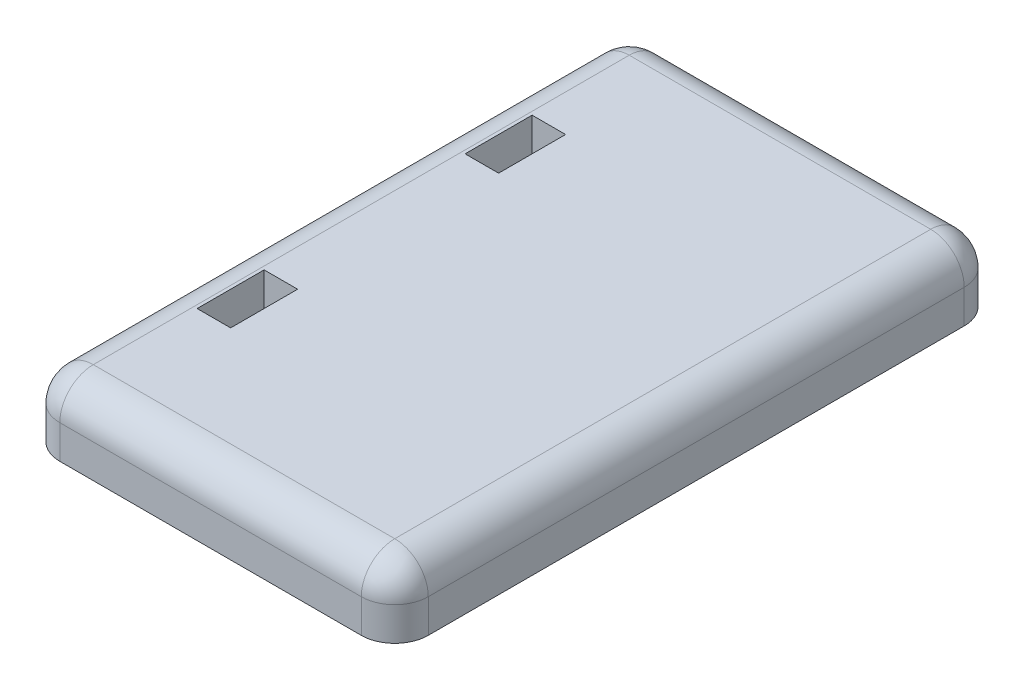
ISO-10303-21;
HEADER;
FILE_DESCRIPTION(('STEP AP214'),'2;1');
FILE_NAME('part.step','',(''),(''),'','','');
FILE_SCHEMA(('AUTOMOTIVE_DESIGN { 1 0 10303 214 1 1 1 1 }'));
ENDSEC;
DATA;
#1=APPLICATION_CONTEXT('core data for automotive mechanical design processes');
#2=APPLICATION_PROTOCOL_DEFINITION('international standard','automotive_design',2000,#1);
#3=PRODUCT_CONTEXT('',#1,'mechanical');
#4=PRODUCT('Part','Part','',(#3));
#5=PRODUCT_RELATED_PRODUCT_CATEGORY('part','',(#4));
#6=PRODUCT_DEFINITION_FORMATION('','',#4);
#7=PRODUCT_DEFINITION_CONTEXT('part definition',#1,'design');
#8=PRODUCT_DEFINITION('design','',#6,#7);
#9=PRODUCT_DEFINITION_SHAPE('','',#8);
#10=(LENGTH_UNIT() NAMED_UNIT(*) SI_UNIT(.MILLI.,.METRE.));
#11=(NAMED_UNIT(*) PLANE_ANGLE_UNIT() SI_UNIT($,.RADIAN.));
#12=(NAMED_UNIT(*) SI_UNIT($,.STERADIAN.) SOLID_ANGLE_UNIT());
#13=UNCERTAINTY_MEASURE_WITH_UNIT(LENGTH_MEASURE(1.E-05),#10,'distance_accuracy_value','');
#14=(GEOMETRIC_REPRESENTATION_CONTEXT(3) GLOBAL_UNCERTAINTY_ASSIGNED_CONTEXT((#13)) GLOBAL_UNIT_ASSIGNED_CONTEXT((#10,
#11,#12)) REPRESENTATION_CONTEXT('',''));
#15=CARTESIAN_POINT('',(0.,0.,0.));
#16=DIRECTION('',(0.,0.,1.));
#17=DIRECTION('',(1.,0.,0.));
#18=AXIS2_PLACEMENT_3D('',#15,#16,#17);
#19=CARTESIAN_POINT('',(0.,10.,0.));
#20=DIRECTION('',(0.,-1.,0.));
#21=DIRECTION('',(0.,0.,-1.));
#22=AXIS2_PLACEMENT_3D('',#19,#20,#21);
#23=PLANE('',#22);
#24=DIRECTION('',(0.,0.,1.));
#25=VECTOR('',#24,1.);
#26=CARTESIAN_POINT('',(-22.5,10.,0.));
#27=LINE('',#26,#25);
#28=CARTESIAN_POINT('',(-22.5,10.,-40.));
#29=VERTEX_POINT('',#28);
#30=CARTESIAN_POINT('',(-22.5,10.,40.));
#31=VERTEX_POINT('',#30);
#32=EDGE_CURVE('E248',#29,#31,#27,.T.);
#33=ORIENTED_EDGE('',*,*,#32,.T.);
#34=DIRECTION('',(1.,0.,0.));
#35=VECTOR('',#34,1.);
#36=CARTESIAN_POINT('',(0.,10.,40.));
#37=LINE('',#36,#35);
#38=CARTESIAN_POINT('',(22.5,10.,40.));
#39=VERTEX_POINT('',#38);
#40=EDGE_CURVE('E11',#31,#39,#37,.T.);
#41=ORIENTED_EDGE('',*,*,#40,.T.);
#42=DIRECTION('',(0.,0.,-1.));
#43=VECTOR('',#42,1.);
#44=CARTESIAN_POINT('',(22.5,10.,0.));
#45=LINE('',#44,#43);
#46=CARTESIAN_POINT('',(22.5,10.,-40.));
#47=VERTEX_POINT('',#46);
#48=EDGE_CURVE('E288',#39,#47,#45,.T.);
#49=ORIENTED_EDGE('',*,*,#48,.T.);
#50=DIRECTION('',(-1.,0.,0.));
#51=VECTOR('',#50,1.);
#52=CARTESIAN_POINT('',(0.,10.,-40.));
#53=LINE('',#52,#51);
#54=EDGE_CURVE('E267',#47,#29,#53,.T.);
#55=ORIENTED_EDGE('',*,*,#54,.T.);
#56=EDGE_LOOP('',(#33,#41,#49,#55));
#57=FACE_BOUND('',#56,.T.);
#58=DIRECTION('',(0.,0.,1.));
#59=VECTOR('',#58,1.);
#60=CARTESIAN_POINT('',(-17.,10.,15.));
#61=LINE('',#60,#59);
#62=CARTESIAN_POINT('',(-17.,10.,15.));
#63=VERTEX_POINT('',#62);
#64=CARTESIAN_POINT('',(-17.,10.,25.));
#65=VERTEX_POINT('',#64);
#66=EDGE_CURVE('E225',#63,#65,#61,.T.);
#67=ORIENTED_EDGE('',*,*,#66,.T.);
#68=DIRECTION('',(1.,0.,0.));
#69=VECTOR('',#68,1.);
#70=CARTESIAN_POINT('',(-22.,10.,25.));
#71=LINE('',#70,#69);
#72=CARTESIAN_POINT('',(-22.,10.,25.));
#73=VERTEX_POINT('',#72);
#74=EDGE_CURVE('E68',#73,#65,#71,.T.);
#75=ORIENTED_EDGE('',*,*,#74,.F.);
#76=DIRECTION('',(0.,0.,1.));
#77=VECTOR('',#76,1.);
#78=CARTESIAN_POINT('',(-22.,10.,15.));
#79=LINE('',#78,#77);
#80=CARTESIAN_POINT('',(-22.,10.,15.));
#81=VERTEX_POINT('',#80);
#82=EDGE_CURVE('E218',#81,#73,#79,.T.);
#83=ORIENTED_EDGE('',*,*,#82,.F.);
#84=DIRECTION('',(1.,0.,0.));
#85=VECTOR('',#84,1.);
#86=CARTESIAN_POINT('',(-22.,10.,15.));
#87=LINE('',#86,#85);
#88=EDGE_CURVE('E221',#81,#63,#87,.T.);
#89=ORIENTED_EDGE('',*,*,#88,.T.);
#90=EDGE_LOOP('',(#67,#75,#83,#89));
#91=FACE_BOUND('',#90,.T.);
#92=DIRECTION('',(0.,0.,1.));
#93=VECTOR('',#92,1.);
#94=CARTESIAN_POINT('',(-17.,10.,0.));
#95=LINE('',#94,#93);
#96=CARTESIAN_POINT('',(-17.,10.,-25.));
#97=VERTEX_POINT('',#96);
#98=CARTESIAN_POINT('',(-17.,10.,-15.));
#99=VERTEX_POINT('',#98);
#100=EDGE_CURVE('E60',#97,#99,#95,.T.);
#101=ORIENTED_EDGE('',*,*,#100,.T.);
#102=DIRECTION('',(1.,0.,0.));
#103=VECTOR('',#102,1.);
#104=CARTESIAN_POINT('',(0.,10.,-15.));
#105=LINE('',#104,#103);
#106=CARTESIAN_POINT('',(-22.,10.,-15.));
#107=VERTEX_POINT('',#106);
#108=EDGE_CURVE('E190',#107,#99,#105,.T.);
#109=ORIENTED_EDGE('',*,*,#108,.F.);
#110=DIRECTION('',(0.,0.,1.));
#111=VECTOR('',#110,1.);
#112=CARTESIAN_POINT('',(-22.,10.,0.));
#113=LINE('',#112,#111);
#114=CARTESIAN_POINT('',(-22.,10.,-25.));
#115=VERTEX_POINT('',#114);
#116=EDGE_CURVE('E193',#115,#107,#113,.T.);
#117=ORIENTED_EDGE('',*,*,#116,.F.);
#118=DIRECTION('',(1.,0.,0.));
#119=VECTOR('',#118,1.);
#120=CARTESIAN_POINT('',(0.,10.,-25.));
#121=LINE('',#120,#119);
#122=EDGE_CURVE('E199',#115,#97,#121,.T.);
#123=ORIENTED_EDGE('',*,*,#122,.T.);
#124=EDGE_LOOP('',(#101,#109,#117,#123));
#125=FACE_BOUND('',#124,.T.);
#126=ADVANCED_FACE('F43',(#57,#91,#125),#23,.F.);
#127=CARTESIAN_POINT('',(27.5,10.,45.));
#128=DIRECTION('',(-1.,0.,0.));
#129=DIRECTION('',(0.,0.,1.));
#130=AXIS2_PLACEMENT_3D('',#127,#128,#129);
#131=PLANE('',#130);
#132=DIRECTION('',(0.,0.,-1.));
#133=VECTOR('',#132,1.);
#134=CARTESIAN_POINT('',(27.5,5.,45.));
#135=LINE('',#134,#133);
#136=CARTESIAN_POINT('',(27.5,5.,-40.));
#137=VERTEX_POINT('',#136);
#138=CARTESIAN_POINT('',(27.5,5.,40.));
#139=VERTEX_POINT('',#138);
#140=EDGE_CURVE('E281',#137,#139,#135,.F.);
#141=ORIENTED_EDGE('',*,*,#140,.T.);
#142=DIRECTION('',(0.,-1.,0.));
#143=VECTOR('',#142,1.);
#144=CARTESIAN_POINT('',(27.5,10.,40.));
#145=LINE('',#144,#143);
#146=CARTESIAN_POINT('',(27.5,0.,40.));
#147=VERTEX_POINT('',#146);
#148=EDGE_CURVE('E310',#139,#147,#145,.T.);
#149=ORIENTED_EDGE('',*,*,#148,.T.);
#150=DIRECTION('',(0.,0.,-1.));
#151=VECTOR('',#150,1.);
#152=CARTESIAN_POINT('',(27.5,0.,45.));
#153=LINE('',#152,#151);
#154=CARTESIAN_POINT('',(27.5,0.,-40.));
#155=VERTEX_POINT('',#154);
#156=EDGE_CURVE('E237',#147,#155,#153,.T.);
#157=ORIENTED_EDGE('',*,*,#156,.T.);
#158=DIRECTION('',(0.,-1.,0.));
#159=VECTOR('',#158,1.);
#160=CARTESIAN_POINT('',(27.5,10.,-40.));
#161=LINE('',#160,#159);
#162=EDGE_CURVE('E284',#155,#137,#161,.F.);
#163=ORIENTED_EDGE('',*,*,#162,.T.);
#164=EDGE_LOOP('',(#141,#149,#157,#163));
#165=FACE_BOUND('',#164,.T.);
#166=ADVANCED_FACE('F334',(#165),#131,.F.);
#167=CARTESIAN_POINT('',(-27.5,10.,-45.));
#168=DIRECTION('',(0.,0.,1.));
#169=DIRECTION('',(1.,0.,0.));
#170=AXIS2_PLACEMENT_3D('',#167,#168,#169);
#171=PLANE('',#170);
#172=DIRECTION('',(-1.,0.,0.));
#173=VECTOR('',#172,1.);
#174=CARTESIAN_POINT('',(-27.5,5.,-45.));
#175=LINE('',#174,#173);
#176=CARTESIAN_POINT('',(-22.5,5.,-45.));
#177=VERTEX_POINT('',#176);
#178=CARTESIAN_POINT('',(22.5,5.,-45.));
#179=VERTEX_POINT('',#178);
#180=EDGE_CURVE('E259',#177,#179,#175,.F.);
#181=ORIENTED_EDGE('',*,*,#180,.T.);
#182=DIRECTION('',(0.,-1.,0.));
#183=VECTOR('',#182,1.);
#184=CARTESIAN_POINT('',(22.5,10.,-45.));
#185=LINE('',#184,#183);
#186=CARTESIAN_POINT('',(22.5,0.,-45.));
#187=VERTEX_POINT('',#186);
#188=EDGE_CURVE('E269',#179,#187,#185,.T.);
#189=ORIENTED_EDGE('',*,*,#188,.T.);
#190=DIRECTION('',(-1.,0.,0.));
#191=VECTOR('',#190,1.);
#192=CARTESIAN_POINT('',(-27.5,0.,-45.));
#193=LINE('',#192,#191);
#194=CARTESIAN_POINT('',(-22.5,0.,-45.));
#195=VERTEX_POINT('',#194);
#196=EDGE_CURVE('E239',#187,#195,#193,.T.);
#197=ORIENTED_EDGE('',*,*,#196,.T.);
#198=DIRECTION('',(0.,-1.,0.));
#199=VECTOR('',#198,1.);
#200=CARTESIAN_POINT('',(-22.5,10.,-45.));
#201=LINE('',#200,#199);
#202=EDGE_CURVE('E262',#195,#177,#201,.F.);
#203=ORIENTED_EDGE('',*,*,#202,.T.);
#204=EDGE_LOOP('',(#181,#189,#197,#203));
#205=FACE_BOUND('',#204,.T.);
#206=ADVANCED_FACE('F358',(#205),#171,.F.);
#207=CARTESIAN_POINT('',(-27.5,10.,45.));
#208=DIRECTION('',(1.,0.,0.));
#209=DIRECTION('',(0.,0.,-1.));
#210=AXIS2_PLACEMENT_3D('',#207,#208,#209);
#211=PLANE('',#210);
#212=DIRECTION('',(0.,0.,1.));
#213=VECTOR('',#212,1.);
#214=CARTESIAN_POINT('',(-27.5,0.,45.));
#215=LINE('',#214,#213);
#216=CARTESIAN_POINT('',(-27.5,0.,-40.));
#217=VERTEX_POINT('',#216);
#218=CARTESIAN_POINT('',(-27.5,0.,40.));
#219=VERTEX_POINT('',#218);
#220=EDGE_CURVE('E242',#217,#219,#215,.T.);
#221=ORIENTED_EDGE('',*,*,#220,.T.);
#222=DIRECTION('',(0.,-1.,0.));
#223=VECTOR('',#222,1.);
#224=CARTESIAN_POINT('',(-27.5,10.,40.));
#225=LINE('',#224,#223);
#226=CARTESIAN_POINT('',(-27.5,5.,40.));
#227=VERTEX_POINT('',#226);
#228=EDGE_CURVE('E306',#219,#227,#225,.F.);
#229=ORIENTED_EDGE('',*,*,#228,.T.);
#230=DIRECTION('',(0.,0.,1.));
#231=VECTOR('',#230,1.);
#232=CARTESIAN_POINT('',(-27.5,5.,45.));
#233=LINE('',#232,#231);
#234=CARTESIAN_POINT('',(-27.5,5.,-40.));
#235=VERTEX_POINT('',#234);
#236=EDGE_CURVE('E251',#227,#235,#233,.F.);
#237=ORIENTED_EDGE('',*,*,#236,.T.);
#238=DIRECTION('',(0.,-1.,0.));
#239=VECTOR('',#238,1.);
#240=CARTESIAN_POINT('',(-27.5,10.,-40.));
#241=LINE('',#240,#239);
#242=EDGE_CURVE('E253',#235,#217,#241,.T.);
#243=ORIENTED_EDGE('',*,*,#242,.T.);
#244=EDGE_LOOP('',(#221,#229,#237,#243));
#245=FACE_BOUND('',#244,.T.);
#246=ADVANCED_FACE('F387',(#245),#211,.F.);
#247=CARTESIAN_POINT('',(-27.5,10.,45.));
#248=DIRECTION('',(0.,0.,-1.));
#249=DIRECTION('',(-1.,0.,0.));
#250=AXIS2_PLACEMENT_3D('',#247,#248,#249);
#251=PLANE('',#250);
#252=DIRECTION('',(1.,0.,0.));
#253=VECTOR('',#252,1.);
#254=CARTESIAN_POINT('',(-27.5,5.,45.));
#255=LINE('',#254,#253);
#256=CARTESIAN_POINT('',(22.5,5.,45.));
#257=VERTEX_POINT('',#256);
#258=CARTESIAN_POINT('',(-22.5,5.,45.));
#259=VERTEX_POINT('',#258);
#260=EDGE_CURVE('E290',#257,#259,#255,.F.);
#261=ORIENTED_EDGE('',*,*,#260,.T.);
#262=DIRECTION('',(0.,-1.,0.));
#263=VECTOR('',#262,1.);
#264=CARTESIAN_POINT('',(-22.5,10.,45.));
#265=LINE('',#264,#263);
#266=CARTESIAN_POINT('',(-22.5,0.,45.));
#267=VERTEX_POINT('',#266);
#268=EDGE_CURVE('E299',#259,#267,#265,.T.);
#269=ORIENTED_EDGE('',*,*,#268,.T.);
#270=DIRECTION('',(1.,0.,0.));
#271=VECTOR('',#270,1.);
#272=CARTESIAN_POINT('',(-27.5,0.,45.));
#273=LINE('',#272,#271);
#274=CARTESIAN_POINT('',(22.5,0.,45.));
#275=VERTEX_POINT('',#274);
#276=EDGE_CURVE('E245',#267,#275,#273,.T.);
#277=ORIENTED_EDGE('',*,*,#276,.T.);
#278=DIRECTION('',(0.,-1.,0.));
#279=VECTOR('',#278,1.);
#280=CARTESIAN_POINT('',(22.5,10.,45.));
#281=LINE('',#280,#279);
#282=EDGE_CURVE('E297',#275,#257,#281,.F.);
#283=ORIENTED_EDGE('',*,*,#282,.T.);
#284=EDGE_LOOP('',(#261,#269,#277,#283));
#285=FACE_BOUND('',#284,.T.);
#286=ADVANCED_FACE('F384',(#285),#251,.F.);
#287=CARTESIAN_POINT('',(0.,0.,0.));
#288=DIRECTION('',(0.,-1.,0.));
#289=DIRECTION('',(0.,0.,-1.));
#290=AXIS2_PLACEMENT_3D('',#287,#288,#289);
#291=PLANE('',#290);
#292=ORIENTED_EDGE('',*,*,#276,.F.);
#293=CARTESIAN_POINT('',(-22.5,0.,40.));
#294=DIRECTION('',(0.,-1.,0.));
#295=DIRECTION('',(0.,0.,-1.));
#296=AXIS2_PLACEMENT_3D('',#293,#294,#295);
#297=CIRCLE('',#296,5.);
#298=EDGE_CURVE('E304',#267,#219,#297,.T.);
#299=ORIENTED_EDGE('',*,*,#298,.T.);
#300=ORIENTED_EDGE('',*,*,#220,.F.);
#301=CARTESIAN_POINT('',(-22.5,0.,-40.));
#302=DIRECTION('',(0.,-1.,0.));
#303=DIRECTION('',(0.,0.,-1.));
#304=AXIS2_PLACEMENT_3D('',#301,#302,#303);
#305=CIRCLE('',#304,5.);
#306=EDGE_CURVE('E256',#217,#195,#305,.T.);
#307=ORIENTED_EDGE('',*,*,#306,.T.);
#308=ORIENTED_EDGE('',*,*,#196,.F.);
#309=CARTESIAN_POINT('',(22.5,0.,-40.));
#310=DIRECTION('',(0.,-1.,0.));
#311=DIRECTION('',(0.,0.,-1.));
#312=AXIS2_PLACEMENT_3D('',#309,#310,#311);
#313=CIRCLE('',#312,5.);
#314=EDGE_CURVE('E278',#187,#155,#313,.T.);
#315=ORIENTED_EDGE('',*,*,#314,.T.);
#316=ORIENTED_EDGE('',*,*,#156,.F.);
#317=CARTESIAN_POINT('',(22.5,0.,40.));
#318=DIRECTION('',(0.,-1.,0.));
#319=DIRECTION('',(0.,0.,-1.));
#320=AXIS2_PLACEMENT_3D('',#317,#318,#319);
#321=CIRCLE('',#320,5.);
#322=EDGE_CURVE('E302',#147,#275,#321,.T.);
#323=ORIENTED_EDGE('',*,*,#322,.T.);
#324=EDGE_LOOP('',(#292,#299,#300,#307,#308,#315,#316,#323));
#325=FACE_BOUND('',#324,.T.);
#326=ADVANCED_FACE('F338',(#325),#291,.T.);
#327=CARTESIAN_POINT('',(-22.5,5.,0.));
#328=DIRECTION('',(0.,0.,1.));
#329=DIRECTION('',(1.,0.,0.));
#330=AXIS2_PLACEMENT_3D('',#327,#328,#329);
#331=CYLINDRICAL_SURFACE('',#330,5.);
#332=ORIENTED_EDGE('',*,*,#236,.F.);
#333=CARTESIAN_POINT('',(-22.5,5.,40.));
#334=DIRECTION('',(0.,0.,1.));
#335=DIRECTION('',(1.,0.,0.));
#336=AXIS2_PLACEMENT_3D('',#333,#334,#335);
#337=CIRCLE('',#336,5.);
#338=EDGE_CURVE('E308',#227,#31,#337,.F.);
#339=ORIENTED_EDGE('',*,*,#338,.T.);
#340=ORIENTED_EDGE('',*,*,#32,.F.);
#341=CARTESIAN_POINT('',(-22.5,5.,-40.));
#342=DIRECTION('',(0.,0.,1.));
#343=DIRECTION('',(1.,0.,0.));
#344=AXIS2_PLACEMENT_3D('',#341,#342,#343);
#345=CIRCLE('',#344,5.);
#346=EDGE_CURVE('E264',#29,#235,#345,.T.);
#347=ORIENTED_EDGE('',*,*,#346,.T.);
#348=EDGE_LOOP('',(#332,#339,#340,#347));
#349=FACE_BOUND('',#348,.T.);
#350=ADVANCED_FACE('F370',(#349),#331,.T.);
#351=CARTESIAN_POINT('',(0.,5.,-40.));
#352=DIRECTION('',(-1.,0.,0.));
#353=DIRECTION('',(0.,0.,1.));
#354=AXIS2_PLACEMENT_3D('',#351,#352,#353);
#355=CYLINDRICAL_SURFACE('',#354,5.);
#356=ORIENTED_EDGE('',*,*,#54,.F.);
#357=CARTESIAN_POINT('',(22.5,5.,-40.));
#358=DIRECTION('',(-1.,0.,0.));
#359=DIRECTION('',(0.,0.,1.));
#360=AXIS2_PLACEMENT_3D('',#357,#358,#359);
#361=CIRCLE('',#360,5.);
#362=EDGE_CURVE('E286',#47,#179,#361,.T.);
#363=ORIENTED_EDGE('',*,*,#362,.T.);
#364=ORIENTED_EDGE('',*,*,#180,.F.);
#365=CARTESIAN_POINT('',(-22.5,5.,-40.));
#366=DIRECTION('',(-1.,0.,0.));
#367=DIRECTION('',(0.,0.,1.));
#368=AXIS2_PLACEMENT_3D('',#365,#366,#367);
#369=CIRCLE('',#368,5.);
#370=EDGE_CURVE('E240',#29,#177,#369,.T.);
#371=ORIENTED_EDGE('',*,*,#370,.F.);
#372=EDGE_LOOP('',(#356,#363,#364,#371));
#373=FACE_BOUND('',#372,.T.);
#374=ADVANCED_FACE('F355',(#373),#355,.T.);
#375=CARTESIAN_POINT('',(-22.5,5.,-40.));
#376=DIRECTION('',(0.,0.,1.));
#377=DIRECTION('',(1.,0.,0.));
#378=AXIS2_PLACEMENT_3D('',#375,#376,#377);
#379=SPHERICAL_SURFACE('',#378,5.);
#380=ORIENTED_EDGE('',*,*,#346,.F.);
#381=ORIENTED_EDGE('',*,*,#370,.T.);
#382=CARTESIAN_POINT('',(-22.5,5.,-40.));
#383=DIRECTION('',(0.,-1.,0.));
#384=DIRECTION('',(0.,0.,-1.));
#385=AXIS2_PLACEMENT_3D('',#382,#383,#384);
#386=CIRCLE('',#385,5.);
#387=EDGE_CURVE('E270',#235,#177,#386,.T.);
#388=ORIENTED_EDGE('',*,*,#387,.F.);
#389=EDGE_LOOP('',(#380,#381,#388));
#390=FACE_BOUND('',#389,.T.);
#391=ADVANCED_FACE('F366',(#390),#379,.T.);
#392=CARTESIAN_POINT('',(-22.5,10.,-40.));
#393=DIRECTION('',(0.,-1.,0.));
#394=DIRECTION('',(0.,0.,-1.));
#395=AXIS2_PLACEMENT_3D('',#392,#393,#394);
#396=CYLINDRICAL_SURFACE('',#395,5.);
#397=ORIENTED_EDGE('',*,*,#387,.T.);
#398=ORIENTED_EDGE('',*,*,#202,.F.);
#399=ORIENTED_EDGE('',*,*,#306,.F.);
#400=ORIENTED_EDGE('',*,*,#242,.F.);
#401=EDGE_LOOP('',(#397,#398,#399,#400));
#402=FACE_BOUND('',#401,.T.);
#403=ADVANCED_FACE('F361',(#402),#396,.T.);
#404=CARTESIAN_POINT('',(22.5,5.,0.));
#405=DIRECTION('',(0.,0.,-1.));
#406=DIRECTION('',(-1.,0.,0.));
#407=AXIS2_PLACEMENT_3D('',#404,#405,#406);
#408=CYLINDRICAL_SURFACE('',#407,5.);
#409=ORIENTED_EDGE('',*,*,#48,.F.);
#410=CARTESIAN_POINT('',(22.5,5.,40.));
#411=DIRECTION('',(0.,0.,-1.));
#412=DIRECTION('',(-1.,0.,0.));
#413=AXIS2_PLACEMENT_3D('',#410,#411,#412);
#414=CIRCLE('',#413,5.);
#415=EDGE_CURVE('E52',#39,#139,#414,.T.);
#416=ORIENTED_EDGE('',*,*,#415,.T.);
#417=ORIENTED_EDGE('',*,*,#140,.F.);
#418=CARTESIAN_POINT('',(22.5,5.,-40.));
#419=DIRECTION('',(0.,0.,-1.));
#420=DIRECTION('',(-1.,0.,0.));
#421=AXIS2_PLACEMENT_3D('',#418,#419,#420);
#422=CIRCLE('',#421,5.);
#423=EDGE_CURVE('E273',#47,#137,#422,.T.);
#424=ORIENTED_EDGE('',*,*,#423,.F.);
#425=EDGE_LOOP('',(#409,#416,#417,#424));
#426=FACE_BOUND('',#425,.T.);
#427=ADVANCED_FACE('F348',(#426),#408,.T.);
#428=CARTESIAN_POINT('',(22.5,5.,-40.));
#429=DIRECTION('',(-1.,0.,0.));
#430=DIRECTION('',(0.,0.,1.));
#431=AXIS2_PLACEMENT_3D('',#428,#429,#430);
#432=SPHERICAL_SURFACE('',#431,5.);
#433=ORIENTED_EDGE('',*,*,#362,.F.);
#434=ORIENTED_EDGE('',*,*,#423,.T.);
#435=CARTESIAN_POINT('',(22.5,5.,-40.));
#436=DIRECTION('',(0.,-1.,0.));
#437=DIRECTION('',(0.,0.,-1.));
#438=AXIS2_PLACEMENT_3D('',#435,#436,#437);
#439=CIRCLE('',#438,5.);
#440=EDGE_CURVE('E291',#179,#137,#439,.T.);
#441=ORIENTED_EDGE('',*,*,#440,.F.);
#442=EDGE_LOOP('',(#433,#434,#441));
#443=FACE_BOUND('',#442,.T.);
#444=ADVANCED_FACE('F351',(#443),#432,.T.);
#445=CARTESIAN_POINT('',(22.5,10.,-40.));
#446=DIRECTION('',(0.,-1.,0.));
#447=DIRECTION('',(0.,0.,-1.));
#448=AXIS2_PLACEMENT_3D('',#445,#446,#447);
#449=CYLINDRICAL_SURFACE('',#448,5.);
#450=ORIENTED_EDGE('',*,*,#440,.T.);
#451=ORIENTED_EDGE('',*,*,#162,.F.);
#452=ORIENTED_EDGE('',*,*,#314,.F.);
#453=ORIENTED_EDGE('',*,*,#188,.F.);
#454=EDGE_LOOP('',(#450,#451,#452,#453));
#455=FACE_BOUND('',#454,.T.);
#456=ADVANCED_FACE('F343',(#455),#449,.T.);
#457=CARTESIAN_POINT('',(22.5,10.,40.));
#458=DIRECTION('',(0.,-1.,0.));
#459=DIRECTION('',(0.,0.,-1.));
#460=AXIS2_PLACEMENT_3D('',#457,#458,#459);
#461=CYLINDRICAL_SURFACE('',#460,5.);
#462=ORIENTED_EDGE('',*,*,#322,.F.);
#463=ORIENTED_EDGE('',*,*,#148,.F.);
#464=CARTESIAN_POINT('',(22.5,5.,40.));
#465=DIRECTION('',(0.,1.,0.));
#466=DIRECTION('',(0.,0.,1.));
#467=AXIS2_PLACEMENT_3D('',#464,#465,#466);
#468=CIRCLE('',#467,5.);
#469=EDGE_CURVE('E47',#257,#139,#468,.T.);
#470=ORIENTED_EDGE('',*,*,#469,.F.);
#471=ORIENTED_EDGE('',*,*,#282,.F.);
#472=EDGE_LOOP('',(#462,#463,#470,#471));
#473=FACE_BOUND('',#472,.T.);
#474=ADVANCED_FACE('F45',(#473),#461,.T.);
#475=CARTESIAN_POINT('',(22.5,5.,40.));
#476=DIRECTION('',(0.,0.,-1.));
#477=DIRECTION('',(-1.,0.,0.));
#478=AXIS2_PLACEMENT_3D('',#475,#476,#477);
#479=SPHERICAL_SURFACE('',#478,5.);
#480=ORIENTED_EDGE('',*,*,#469,.T.);
#481=ORIENTED_EDGE('',*,*,#415,.F.);
#482=CARTESIAN_POINT('',(22.5,5.,40.));
#483=DIRECTION('',(-1.,0.,0.));
#484=DIRECTION('',(0.,0.,1.));
#485=AXIS2_PLACEMENT_3D('',#482,#483,#484);
#486=CIRCLE('',#485,5.);
#487=EDGE_CURVE('E317',#257,#39,#486,.T.);
#488=ORIENTED_EDGE('',*,*,#487,.F.);
#489=EDGE_LOOP('',(#480,#481,#488));
#490=FACE_BOUND('',#489,.T.);
#491=ADVANCED_FACE('F327',(#490),#479,.T.);
#492=CARTESIAN_POINT('',(0.,5.,40.));
#493=DIRECTION('',(1.,0.,0.));
#494=DIRECTION('',(0.,0.,-1.));
#495=AXIS2_PLACEMENT_3D('',#492,#493,#494);
#496=CYLINDRICAL_SURFACE('',#495,5.);
#497=ORIENTED_EDGE('',*,*,#487,.T.);
#498=ORIENTED_EDGE('',*,*,#40,.F.);
#499=CARTESIAN_POINT('',(-22.5,5.,40.));
#500=DIRECTION('',(-1.,0.,0.));
#501=DIRECTION('',(0.,0.,1.));
#502=AXIS2_PLACEMENT_3D('',#499,#500,#501);
#503=CIRCLE('',#502,5.);
#504=EDGE_CURVE('E315',#259,#31,#503,.T.);
#505=ORIENTED_EDGE('',*,*,#504,.F.);
#506=ORIENTED_EDGE('',*,*,#260,.F.);
#507=EDGE_LOOP('',(#497,#498,#505,#506));
#508=FACE_BOUND('',#507,.T.);
#509=ADVANCED_FACE('F375',(#508),#496,.T.);
#510=CARTESIAN_POINT('',(-22.5,5.,40.));
#511=DIRECTION('',(0.,0.,-1.));
#512=DIRECTION('',(-1.,0.,0.));
#513=AXIS2_PLACEMENT_3D('',#510,#511,#512);
#514=SPHERICAL_SURFACE('',#513,5.);
#515=ORIENTED_EDGE('',*,*,#504,.T.);
#516=ORIENTED_EDGE('',*,*,#338,.F.);
#517=CARTESIAN_POINT('',(-22.5,5.,40.));
#518=DIRECTION('',(0.,-1.,0.));
#519=DIRECTION('',(0.,0.,-1.));
#520=AXIS2_PLACEMENT_3D('',#517,#518,#519);
#521=CIRCLE('',#520,5.);
#522=EDGE_CURVE('E205',#259,#227,#521,.T.);
#523=ORIENTED_EDGE('',*,*,#522,.F.);
#524=EDGE_LOOP('',(#515,#516,#523));
#525=FACE_BOUND('',#524,.T.);
#526=ADVANCED_FACE('F378',(#525),#514,.T.);
#527=CARTESIAN_POINT('',(-22.5,10.,40.));
#528=DIRECTION('',(0.,-1.,0.));
#529=DIRECTION('',(0.,0.,-1.));
#530=AXIS2_PLACEMENT_3D('',#527,#528,#529);
#531=CYLINDRICAL_SURFACE('',#530,5.);
#532=ORIENTED_EDGE('',*,*,#522,.T.);
#533=ORIENTED_EDGE('',*,*,#228,.F.);
#534=ORIENTED_EDGE('',*,*,#298,.F.);
#535=ORIENTED_EDGE('',*,*,#268,.F.);
#536=EDGE_LOOP('',(#532,#533,#534,#535));
#537=FACE_BOUND('',#536,.T.);
#538=ADVANCED_FACE('F382',(#537),#531,.T.);
#539=CARTESIAN_POINT('',(-22.,5.,25.));
#540=DIRECTION('',(0.,0.,1.));
#541=DIRECTION('',(1.,0.,0.));
#542=AXIS2_PLACEMENT_3D('',#539,#540,#541);
#543=PLANE('',#542);
#544=ORIENTED_EDGE('',*,*,#74,.T.);
#545=DIRECTION('',(0.,1.,0.));
#546=VECTOR('',#545,1.);
#547=CARTESIAN_POINT('',(-17.,5.,25.));
#548=LINE('',#547,#546);
#549=CARTESIAN_POINT('',(-17.,5.,25.));
#550=VERTEX_POINT('',#549);
#551=EDGE_CURVE('E209',#550,#65,#548,.T.);
#552=ORIENTED_EDGE('',*,*,#551,.F.);
#553=DIRECTION('',(1.,0.,0.));
#554=VECTOR('',#553,1.);
#555=CARTESIAN_POINT('',(-22.,5.,25.));
#556=LINE('',#555,#554);
#557=CARTESIAN_POINT('',(-22.,5.,25.));
#558=VERTEX_POINT('',#557);
#559=EDGE_CURVE('E222',#558,#550,#556,.T.);
#560=ORIENTED_EDGE('',*,*,#559,.F.);
#561=DIRECTION('',(0.,1.,0.));
#562=VECTOR('',#561,1.);
#563=CARTESIAN_POINT('',(-22.,5.,25.));
#564=LINE('',#563,#562);
#565=EDGE_CURVE('E216',#558,#73,#564,.T.);
#566=ORIENTED_EDGE('',*,*,#565,.T.);
#567=EDGE_LOOP('',(#544,#552,#560,#566));
#568=FACE_BOUND('',#567,.T.);
#569=ADVANCED_FACE('F429',(#568),#543,.F.);
#570=CARTESIAN_POINT('',(-22.,5.,15.));
#571=DIRECTION('',(-1.,0.,0.));
#572=DIRECTION('',(0.,0.,1.));
#573=AXIS2_PLACEMENT_3D('',#570,#571,#572);
#574=PLANE('',#573);
#575=ORIENTED_EDGE('',*,*,#82,.T.);
#576=ORIENTED_EDGE('',*,*,#565,.F.);
#577=DIRECTION('',(0.,0.,1.));
#578=VECTOR('',#577,1.);
#579=CARTESIAN_POINT('',(-22.,5.,15.));
#580=LINE('',#579,#578);
#581=CARTESIAN_POINT('',(-22.,5.,15.));
#582=VERTEX_POINT('',#581);
#583=EDGE_CURVE('E211',#582,#558,#580,.T.);
#584=ORIENTED_EDGE('',*,*,#583,.F.);
#585=DIRECTION('',(0.,1.,0.));
#586=VECTOR('',#585,1.);
#587=CARTESIAN_POINT('',(-22.,5.,15.));
#588=LINE('',#587,#586);
#589=EDGE_CURVE('E214',#582,#81,#588,.T.);
#590=ORIENTED_EDGE('',*,*,#589,.T.);
#591=EDGE_LOOP('',(#575,#576,#584,#590));
#592=FACE_BOUND('',#591,.T.);
#593=ADVANCED_FACE('F548',(#592),#574,.F.);
#594=CARTESIAN_POINT('',(-22.,5.,15.));
#595=DIRECTION('',(0.,0.,1.));
#596=DIRECTION('',(1.,0.,0.));
#597=AXIS2_PLACEMENT_3D('',#594,#595,#596);
#598=PLANE('',#597);
#599=ORIENTED_EDGE('',*,*,#88,.F.);
#600=ORIENTED_EDGE('',*,*,#589,.F.);
#601=DIRECTION('',(1.,0.,0.));
#602=VECTOR('',#601,1.);
#603=CARTESIAN_POINT('',(-22.,5.,15.));
#604=LINE('',#603,#602);
#605=CARTESIAN_POINT('',(-17.,5.,15.));
#606=VERTEX_POINT('',#605);
#607=EDGE_CURVE('E231',#582,#606,#604,.T.);
#608=ORIENTED_EDGE('',*,*,#607,.T.);
#609=DIRECTION('',(0.,1.,0.));
#610=VECTOR('',#609,1.);
#611=CARTESIAN_POINT('',(-17.,5.,15.));
#612=LINE('',#611,#610);
#613=EDGE_CURVE('E212',#606,#63,#612,.T.);
#614=ORIENTED_EDGE('',*,*,#613,.T.);
#615=EDGE_LOOP('',(#599,#600,#608,#614));
#616=FACE_BOUND('',#615,.T.);
#617=ADVANCED_FACE('F557',(#616),#598,.T.);
#618=CARTESIAN_POINT('',(-17.,5.,15.));
#619=DIRECTION('',(-1.,0.,0.));
#620=DIRECTION('',(0.,0.,1.));
#621=AXIS2_PLACEMENT_3D('',#618,#619,#620);
#622=PLANE('',#621);
#623=ORIENTED_EDGE('',*,*,#66,.F.);
#624=ORIENTED_EDGE('',*,*,#613,.F.);
#625=DIRECTION('',(0.,0.,1.));
#626=VECTOR('',#625,1.);
#627=CARTESIAN_POINT('',(-17.,5.,15.));
#628=LINE('',#627,#626);
#629=EDGE_CURVE('E233',#606,#550,#628,.T.);
#630=ORIENTED_EDGE('',*,*,#629,.T.);
#631=ORIENTED_EDGE('',*,*,#551,.T.);
#632=EDGE_LOOP('',(#623,#624,#630,#631));
#633=FACE_BOUND('',#632,.T.);
#634=ADVANCED_FACE('F566',(#633),#622,.T.);
#635=CARTESIAN_POINT('',(0.,5.,0.));
#636=DIRECTION('',(0.,-1.,0.));
#637=DIRECTION('',(0.,0.,-1.));
#638=AXIS2_PLACEMENT_3D('',#635,#636,#637);
#639=PLANE('',#638);
#640=ORIENTED_EDGE('',*,*,#559,.T.);
#641=ORIENTED_EDGE('',*,*,#629,.F.);
#642=ORIENTED_EDGE('',*,*,#607,.F.);
#643=ORIENTED_EDGE('',*,*,#583,.T.);
#644=EDGE_LOOP('',(#640,#641,#642,#643));
#645=FACE_BOUND('',#644,.T.);
#646=ADVANCED_FACE('F406',(#645),#639,.F.);
#647=CARTESIAN_POINT('',(-17.,5.,0.));
#648=DIRECTION('',(-1.,0.,0.));
#649=DIRECTION('',(0.,0.,1.));
#650=AXIS2_PLACEMENT_3D('',#647,#648,#649);
#651=PLANE('',#650);
#652=ORIENTED_EDGE('',*,*,#100,.F.);
#653=DIRECTION('',(0.,1.,0.));
#654=VECTOR('',#653,1.);
#655=CARTESIAN_POINT('',(-17.,5.,-25.));
#656=LINE('',#655,#654);
#657=CARTESIAN_POINT('',(-17.,5.,-25.));
#658=VERTEX_POINT('',#657);
#659=EDGE_CURVE('E173',#658,#97,#656,.T.);
#660=ORIENTED_EDGE('',*,*,#659,.F.);
#661=DIRECTION('',(0.,0.,1.));
#662=VECTOR('',#661,1.);
#663=CARTESIAN_POINT('',(-17.,5.,0.));
#664=LINE('',#663,#662);
#665=CARTESIAN_POINT('',(-17.,5.,-15.));
#666=VERTEX_POINT('',#665);
#667=EDGE_CURVE('E181',#658,#666,#664,.T.);
#668=ORIENTED_EDGE('',*,*,#667,.T.);
#669=DIRECTION('',(0.,1.,0.));
#670=VECTOR('',#669,1.);
#671=CARTESIAN_POINT('',(-17.,5.,-15.));
#672=LINE('',#671,#670);
#673=EDGE_CURVE('E203',#666,#99,#672,.T.);
#674=ORIENTED_EDGE('',*,*,#673,.T.);
#675=EDGE_LOOP('',(#652,#660,#668,#674));
#676=FACE_BOUND('',#675,.T.);
#677=ADVANCED_FACE('F183',(#676),#651,.T.);
#678=CARTESIAN_POINT('',(0.,5.,-15.));
#679=DIRECTION('',(0.,0.,1.));
#680=DIRECTION('',(1.,0.,0.));
#681=AXIS2_PLACEMENT_3D('',#678,#679,#680);
#682=PLANE('',#681);
#683=ORIENTED_EDGE('',*,*,#108,.T.);
#684=ORIENTED_EDGE('',*,*,#673,.F.);
#685=DIRECTION('',(1.,0.,0.));
#686=VECTOR('',#685,1.);
#687=CARTESIAN_POINT('',(0.,5.,-15.));
#688=LINE('',#687,#686);
#689=CARTESIAN_POINT('',(-22.,5.,-15.));
#690=VERTEX_POINT('',#689);
#691=EDGE_CURVE('E185',#690,#666,#688,.T.);
#692=ORIENTED_EDGE('',*,*,#691,.F.);
#693=DIRECTION('',(0.,1.,0.));
#694=VECTOR('',#693,1.);
#695=CARTESIAN_POINT('',(-22.,5.,-15.));
#696=LINE('',#695,#694);
#697=EDGE_CURVE('E206',#690,#107,#696,.T.);
#698=ORIENTED_EDGE('',*,*,#697,.T.);
#699=EDGE_LOOP('',(#683,#684,#692,#698));
#700=FACE_BOUND('',#699,.T.);
#701=ADVANCED_FACE('F593',(#700),#682,.F.);
#702=CARTESIAN_POINT('',(-22.,5.,0.));
#703=DIRECTION('',(-1.,0.,0.));
#704=DIRECTION('',(0.,0.,1.));
#705=AXIS2_PLACEMENT_3D('',#702,#703,#704);
#706=PLANE('',#705);
#707=ORIENTED_EDGE('',*,*,#116,.T.);
#708=ORIENTED_EDGE('',*,*,#697,.F.);
#709=DIRECTION('',(0.,0.,1.));
#710=VECTOR('',#709,1.);
#711=CARTESIAN_POINT('',(-22.,5.,0.));
#712=LINE('',#711,#710);
#713=CARTESIAN_POINT('',(-22.,5.,-25.));
#714=VERTEX_POINT('',#713);
#715=EDGE_CURVE('E180',#714,#690,#712,.T.);
#716=ORIENTED_EDGE('',*,*,#715,.F.);
#717=DIRECTION('',(0.,1.,0.));
#718=VECTOR('',#717,1.);
#719=CARTESIAN_POINT('',(-22.,5.,-25.));
#720=LINE('',#719,#718);
#721=EDGE_CURVE('E175',#714,#115,#720,.T.);
#722=ORIENTED_EDGE('',*,*,#721,.T.);
#723=EDGE_LOOP('',(#707,#708,#716,#722));
#724=FACE_BOUND('',#723,.T.);
#725=ADVANCED_FACE('F602',(#724),#706,.F.);
#726=CARTESIAN_POINT('',(0.,5.,-25.));
#727=DIRECTION('',(0.,0.,1.));
#728=DIRECTION('',(1.,0.,0.));
#729=AXIS2_PLACEMENT_3D('',#726,#727,#728);
#730=PLANE('',#729);
#731=ORIENTED_EDGE('',*,*,#122,.F.);
#732=ORIENTED_EDGE('',*,*,#721,.F.);
#733=DIRECTION('',(1.,0.,0.));
#734=VECTOR('',#733,1.);
#735=CARTESIAN_POINT('',(0.,5.,-25.));
#736=LINE('',#735,#734);
#737=EDGE_CURVE('E170',#714,#658,#736,.T.);
#738=ORIENTED_EDGE('',*,*,#737,.T.);
#739=ORIENTED_EDGE('',*,*,#659,.T.);
#740=EDGE_LOOP('',(#731,#732,#738,#739));
#741=FACE_BOUND('',#740,.T.);
#742=ADVANCED_FACE('F172',(#741),#730,.T.);
#743=CARTESIAN_POINT('',(0.,5.,0.));
#744=DIRECTION('',(0.,1.,0.));
#745=DIRECTION('',(0.,0.,1.));
#746=AXIS2_PLACEMENT_3D('',#743,#744,#745);
#747=PLANE('',#746);
#748=ORIENTED_EDGE('',*,*,#667,.F.);
#749=ORIENTED_EDGE('',*,*,#737,.F.);
#750=ORIENTED_EDGE('',*,*,#715,.T.);
#751=ORIENTED_EDGE('',*,*,#691,.T.);
#752=EDGE_LOOP('',(#748,#749,#750,#751));
#753=FACE_BOUND('',#752,.T.);
#754=ADVANCED_FACE('F188',(#753),#747,.T.);
#755=CLOSED_SHELL('',(#126,#166,#206,#246,#286,#326,#350,#374,#391,#403,#427,#444,#456,#474,
#491,#509,#526,#538,#569,#593,#617,#634,#646,#677,#701,#725,#742,#754));
#756=MANIFOLD_SOLID_BREP('B2',#755);
#757=ADVANCED_BREP_SHAPE_REPRESENTATION('',(#18,#756),#14);
#758=SHAPE_DEFINITION_REPRESENTATION(#9,#757);
ENDSEC;
END-ISO-10303-21;
